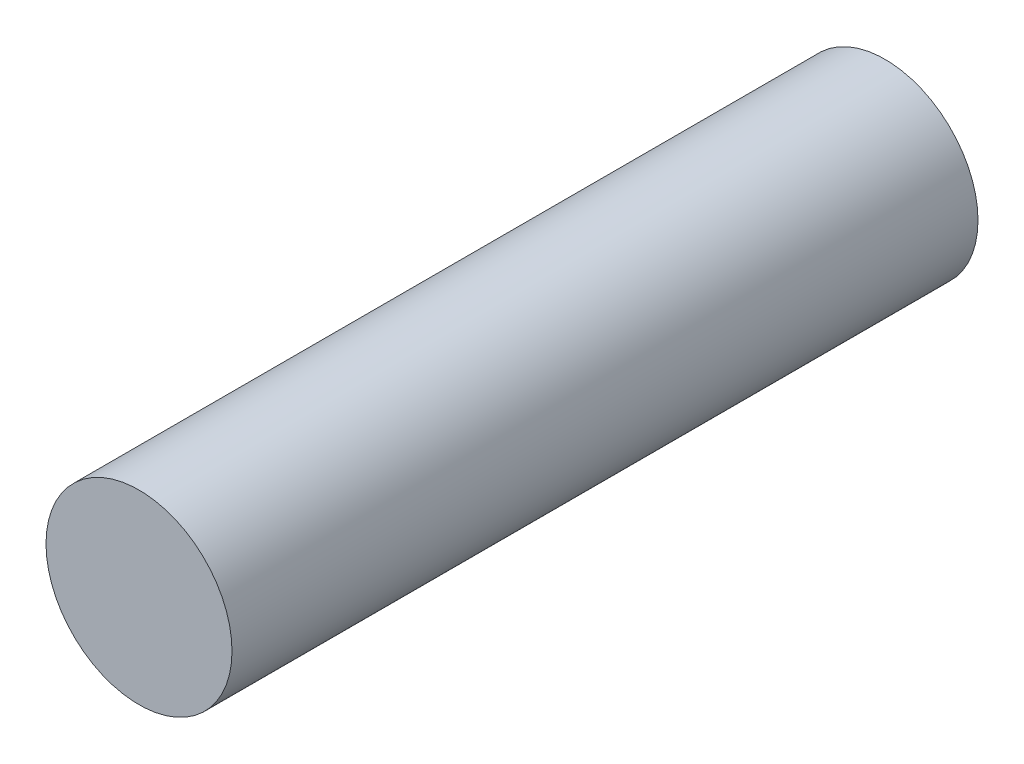
ISO-10303-21;
HEADER;
FILE_DESCRIPTION(('STEP AP214'),'2;1');
FILE_NAME('part.step','',(''),(''),'','','');
FILE_SCHEMA(('AUTOMOTIVE_DESIGN { 1 0 10303 214 1 1 1 1 }'));
ENDSEC;
DATA;
#1=APPLICATION_CONTEXT('core data for automotive mechanical design processes');
#2=APPLICATION_PROTOCOL_DEFINITION('international standard','automotive_design',2000,#1);
#3=PRODUCT_CONTEXT('',#1,'mechanical');
#4=PRODUCT('Part','Part','',(#3));
#5=PRODUCT_RELATED_PRODUCT_CATEGORY('part','',(#4));
#6=PRODUCT_DEFINITION_FORMATION('','',#4);
#7=PRODUCT_DEFINITION_CONTEXT('part definition',#1,'design');
#8=PRODUCT_DEFINITION('design','',#6,#7);
#9=PRODUCT_DEFINITION_SHAPE('','',#8);
#10=(LENGTH_UNIT() NAMED_UNIT(*) SI_UNIT(.MILLI.,.METRE.));
#11=(NAMED_UNIT(*) PLANE_ANGLE_UNIT() SI_UNIT($,.RADIAN.));
#12=(NAMED_UNIT(*) SI_UNIT($,.STERADIAN.) SOLID_ANGLE_UNIT());
#13=UNCERTAINTY_MEASURE_WITH_UNIT(LENGTH_MEASURE(1.E-05),#10,'distance_accuracy_value','');
#14=(GEOMETRIC_REPRESENTATION_CONTEXT(3) GLOBAL_UNCERTAINTY_ASSIGNED_CONTEXT((#13)) GLOBAL_UNIT_ASSIGNED_CONTEXT((#10,
#11,#12)) REPRESENTATION_CONTEXT('',''));
#15=CARTESIAN_POINT('',(0.,0.,0.));
#16=DIRECTION('',(0.,0.,1.));
#17=DIRECTION('',(1.,0.,0.));
#18=AXIS2_PLACEMENT_3D('',#15,#16,#17);
#19=CARTESIAN_POINT('',(0.,0.,19.05));
#20=DIRECTION('',(0.,0.,-1.));
#21=DIRECTION('',(-1.,0.,0.));
#22=AXIS2_PLACEMENT_3D('',#19,#20,#21);
#23=CYLINDRICAL_SURFACE('',#22,2.3749);
#24=CARTESIAN_POINT('',(0.,0.,19.05));
#25=DIRECTION('',(0.,0.,1.));
#26=DIRECTION('',(1.,0.,0.));
#27=AXIS2_PLACEMENT_3D('',#24,#25,#26);
#28=CIRCLE('',#27,2.3749);
#29=CARTESIAN_POINT('',(2.3749,0.,19.05));
#30=VERTEX_POINT('',#29);
#31=EDGE_CURVE('E10',#30,#30,#28,.T.);
#32=ORIENTED_EDGE('',*,*,#31,.F.);
#33=EDGE_LOOP('',(#32));
#34=FACE_BOUND('',#33,.T.);
#35=CARTESIAN_POINT('',(0.,0.,0.));
#36=DIRECTION('',(0.,0.,1.));
#37=DIRECTION('',(1.,0.,0.));
#38=AXIS2_PLACEMENT_3D('',#35,#36,#37);
#39=CIRCLE('',#38,2.3749);
#40=CARTESIAN_POINT('',(2.3749,0.,0.));
#41=VERTEX_POINT('',#40);
#42=EDGE_CURVE('E37',#41,#41,#39,.T.);
#43=ORIENTED_EDGE('',*,*,#42,.T.);
#44=EDGE_LOOP('',(#43));
#45=FACE_BOUND('',#44,.T.);
#46=ADVANCED_FACE('F34',(#34,#45),#23,.T.);
#47=CARTESIAN_POINT('',(0.,0.,19.05));
#48=DIRECTION('',(0.,0.,1.));
#49=DIRECTION('',(1.,0.,0.));
#50=AXIS2_PLACEMENT_3D('',#47,#48,#49);
#51=PLANE('',#50);
#52=ORIENTED_EDGE('',*,*,#31,.T.);
#53=EDGE_LOOP('',(#52));
#54=FACE_BOUND('',#53,.T.);
#55=ADVANCED_FACE('F49',(#54),#51,.T.);
#56=CARTESIAN_POINT('',(0.,0.,0.));
#57=DIRECTION('',(0.,0.,1.));
#58=DIRECTION('',(1.,0.,0.));
#59=AXIS2_PLACEMENT_3D('',#56,#57,#58);
#60=PLANE('',#59);
#61=ORIENTED_EDGE('',*,*,#42,.F.);
#62=EDGE_LOOP('',(#61));
#63=FACE_BOUND('',#62,.T.);
#64=ADVANCED_FACE('F47',(#63),#60,.F.);
#65=CLOSED_SHELL('',(#46,#55,#64));
#66=MANIFOLD_SOLID_BREP('B2',#65);
#67=ADVANCED_BREP_SHAPE_REPRESENTATION('',(#18,#66),#14);
#68=SHAPE_DEFINITION_REPRESENTATION(#9,#67);
ENDSEC;
END-ISO-10303-21;
